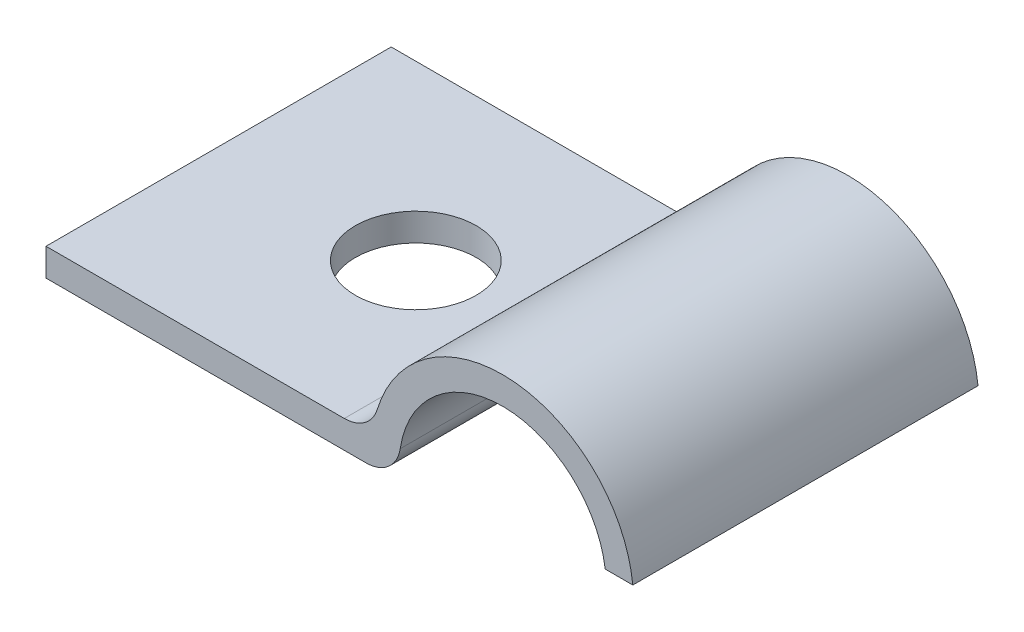
ISO-10303-21;
HEADER;
FILE_DESCRIPTION(('STEP AP214'),'2;1');
FILE_NAME('part.step','',(''),(''),'','','');
FILE_SCHEMA(('AUTOMOTIVE_DESIGN { 1 0 10303 214 1 1 1 1 }'));
ENDSEC;
DATA;
#1=APPLICATION_CONTEXT('core data for automotive mechanical design processes');
#2=APPLICATION_PROTOCOL_DEFINITION('international standard','automotive_design',2000,#1);
#3=PRODUCT_CONTEXT('',#1,'mechanical');
#4=PRODUCT('Part','Part','',(#3));
#5=PRODUCT_RELATED_PRODUCT_CATEGORY('part','',(#4));
#6=PRODUCT_DEFINITION_FORMATION('','',#4);
#7=PRODUCT_DEFINITION_CONTEXT('part definition',#1,'design');
#8=PRODUCT_DEFINITION('design','',#6,#7);
#9=PRODUCT_DEFINITION_SHAPE('','',#8);
#10=(LENGTH_UNIT() NAMED_UNIT(*) SI_UNIT(.MILLI.,.METRE.));
#11=(NAMED_UNIT(*) PLANE_ANGLE_UNIT() SI_UNIT($,.RADIAN.));
#12=(NAMED_UNIT(*) SI_UNIT($,.STERADIAN.) SOLID_ANGLE_UNIT());
#13=UNCERTAINTY_MEASURE_WITH_UNIT(LENGTH_MEASURE(1.E-05),#10,'distance_accuracy_value','');
#14=(GEOMETRIC_REPRESENTATION_CONTEXT(3) GLOBAL_UNCERTAINTY_ASSIGNED_CONTEXT((#13)) GLOBAL_UNIT_ASSIGNED_CONTEXT((#10,
#11,#12)) REPRESENTATION_CONTEXT('',''));
#15=CARTESIAN_POINT('',(0.,0.,0.));
#16=DIRECTION('',(0.,0.,1.));
#17=DIRECTION('',(1.,0.,0.));
#18=AXIS2_PLACEMENT_3D('',#15,#16,#17);
#19=CARTESIAN_POINT('',(0.,0.,10.));
#20=DIRECTION('',(1.,0.,0.));
#21=DIRECTION('',(0.,0.,-1.));
#22=AXIS2_PLACEMENT_3D('',#19,#20,#21);
#23=PLANE('',#22);
#24=DIRECTION('',(0.,-1.,0.));
#25=VECTOR('',#24,1.);
#26=CARTESIAN_POINT('',(0.,0.,0.));
#27=LINE('',#26,#25);
#28=CARTESIAN_POINT('',(0.,0.800000000000023,0.));
#29=VERTEX_POINT('',#28);
#30=CARTESIAN_POINT('',(0.,0.,0.));
#31=VERTEX_POINT('',#30);
#32=EDGE_CURVE('E115',#29,#31,#27,.T.);
#33=ORIENTED_EDGE('',*,*,#32,.T.);
#34=DIRECTION('',(0.,0.,-1.));
#35=VECTOR('',#34,1.);
#36=CARTESIAN_POINT('',(0.,0.,10.));
#37=LINE('',#36,#35);
#38=CARTESIAN_POINT('',(0.,0.,10.));
#39=VERTEX_POINT('',#38);
#40=EDGE_CURVE('E98',#39,#31,#37,.T.);
#41=ORIENTED_EDGE('',*,*,#40,.F.);
#42=DIRECTION('',(0.,-1.,0.));
#43=VECTOR('',#42,1.);
#44=CARTESIAN_POINT('',(0.,0.,10.));
#45=LINE('',#44,#43);
#46=CARTESIAN_POINT('',(0.,0.800000000000023,10.));
#47=VERTEX_POINT('',#46);
#48=EDGE_CURVE('E103',#47,#39,#45,.T.);
#49=ORIENTED_EDGE('',*,*,#48,.F.);
#50=DIRECTION('',(0.,0.,-1.));
#51=VECTOR('',#50,1.);
#52=CARTESIAN_POINT('',(0.,0.800000000000023,10.));
#53=LINE('',#52,#51);
#54=EDGE_CURVE('E156',#47,#29,#53,.T.);
#55=ORIENTED_EDGE('',*,*,#54,.T.);
#56=EDGE_LOOP('',(#33,#41,#49,#55));
#57=FACE_BOUND('',#56,.T.);
#58=ADVANCED_FACE('F32',(#57),#23,.F.);
#59=CARTESIAN_POINT('',(0.,0.,10.));
#60=DIRECTION('',(0.,1.,0.));
#61=DIRECTION('',(0.,0.,1.));
#62=AXIS2_PLACEMENT_3D('',#59,#60,#61);
#63=PLANE('',#62);
#64=CARTESIAN_POINT('',(5.71339312526814,0.,5.));
#65=DIRECTION('',(0.,1.,0.));
#66=DIRECTION('',(-1.,0.,0.));
#67=AXIS2_PLACEMENT_3D('',#64,#65,#66);
#68=CIRCLE('',#67,1.75);
#69=CARTESIAN_POINT('',(3.96339312526814,0.,5.));
#70=VERTEX_POINT('',#69);
#71=EDGE_CURVE('E165',#70,#70,#68,.T.);
#72=ORIENTED_EDGE('',*,*,#71,.T.);
#73=EDGE_LOOP('',(#72));
#74=FACE_BOUND('',#73,.T.);
#75=DIRECTION('',(1.,0.,0.));
#76=VECTOR('',#75,1.);
#77=CARTESIAN_POINT('',(0.,0.,0.));
#78=LINE('',#77,#76);
#79=CARTESIAN_POINT('',(9.27204226387923,0.,0.));
#80=VERTEX_POINT('',#79);
#81=EDGE_CURVE('E164',#31,#80,#78,.T.);
#82=ORIENTED_EDGE('',*,*,#81,.T.);
#83=DIRECTION('',(0.,0.,-1.));
#84=VECTOR('',#83,1.);
#85=CARTESIAN_POINT('',(9.27204226387929,0.,10.));
#86=LINE('',#85,#84);
#87=CARTESIAN_POINT('',(9.27204226387929,0.,10.));
#88=VERTEX_POINT('',#87);
#89=EDGE_CURVE('E47',#80,#88,#86,.F.);
#90=ORIENTED_EDGE('',*,*,#89,.T.);
#91=DIRECTION('',(1.,0.,0.));
#92=VECTOR('',#91,1.);
#93=CARTESIAN_POINT('',(0.,0.,10.));
#94=LINE('',#93,#92);
#95=EDGE_CURVE('E94',#39,#88,#94,.T.);
#96=ORIENTED_EDGE('',*,*,#95,.F.);
#97=ORIENTED_EDGE('',*,*,#40,.T.);
#98=EDGE_LOOP('',(#82,#90,#96,#97));
#99=FACE_BOUND('',#98,.T.);
#100=ADVANCED_FACE('F96',(#74,#99),#63,.F.);
#101=CARTESIAN_POINT('',(13.2267862505363,0.399999999999956,10.));
#102=DIRECTION('',(0.,0.,-1.));
#103=DIRECTION('',(-1.,0.,0.));
#104=AXIS2_PLACEMENT_3D('',#101,#102,#103);
#105=CYLINDRICAL_SURFACE('',#104,3.);
#106=CARTESIAN_POINT('',(13.2267862505363,0.399999999999956,10.));
#107=DIRECTION('',(0.,0.,-1.));
#108=DIRECTION('',(-1.,0.,0.));
#109=AXIS2_PLACEMENT_3D('',#106,#107,#108);
#110=CIRCLE('',#109,3.);
#111=CARTESIAN_POINT('',(10.2607282605435,0.850000000000017,10.));
#112=VERTEX_POINT('',#111);
#113=CARTESIAN_POINT('',(16.2,0.800000000000023,10.));
#114=VERTEX_POINT('',#113);
#115=EDGE_CURVE('E102',#112,#114,#110,.T.);
#116=ORIENTED_EDGE('',*,*,#115,.F.);
#117=DIRECTION('',(0.,0.,-1.));
#118=VECTOR('',#117,1.);
#119=CARTESIAN_POINT('',(10.2607282605435,0.850000000000017,10.));
#120=LINE('',#119,#118);
#121=CARTESIAN_POINT('',(10.2607282605435,0.850000000000017,0.));
#122=VERTEX_POINT('',#121);
#123=EDGE_CURVE('E128',#112,#122,#120,.T.);
#124=ORIENTED_EDGE('',*,*,#123,.T.);
#125=CARTESIAN_POINT('',(13.2267862505363,0.399999999999956,0.));
#126=DIRECTION('',(0.,0.,-1.));
#127=DIRECTION('',(-1.,0.,0.));
#128=AXIS2_PLACEMENT_3D('',#125,#126,#127);
#129=CIRCLE('',#128,3.);
#130=CARTESIAN_POINT('',(16.2,0.800000000000023,0.));
#131=VERTEX_POINT('',#130);
#132=EDGE_CURVE('E167',#122,#131,#129,.T.);
#133=ORIENTED_EDGE('',*,*,#132,.T.);
#134=DIRECTION('',(0.,0.,-1.));
#135=VECTOR('',#134,1.);
#136=CARTESIAN_POINT('',(16.2,0.800000000000023,10.));
#137=LINE('',#136,#135);
#138=EDGE_CURVE('E117',#114,#131,#137,.T.);
#139=ORIENTED_EDGE('',*,*,#138,.F.);
#140=EDGE_LOOP('',(#116,#124,#133,#139));
#141=FACE_BOUND('',#140,.T.);
#142=ADVANCED_FACE('F175',(#141),#105,.F.);
#143=CARTESIAN_POINT('',(16.2,0.800000000000023,10.));
#144=DIRECTION('',(0.,1.,0.));
#145=DIRECTION('',(0.,0.,1.));
#146=AXIS2_PLACEMENT_3D('',#143,#144,#145);
#147=PLANE('',#146);
#148=DIRECTION('',(1.,0.,0.));
#149=VECTOR('',#148,1.);
#150=CARTESIAN_POINT('',(16.2,0.800000000000023,0.));
#151=LINE('',#150,#149);
#152=CARTESIAN_POINT('',(17.,0.800000000000023,0.));
#153=VERTEX_POINT('',#152);
#154=EDGE_CURVE('E149',#131,#153,#151,.T.);
#155=ORIENTED_EDGE('',*,*,#154,.T.);
#156=DIRECTION('',(0.,0.,-1.));
#157=VECTOR('',#156,1.);
#158=CARTESIAN_POINT('',(17.,0.800000000000023,10.));
#159=LINE('',#158,#157);
#160=CARTESIAN_POINT('',(17.,0.800000000000023,10.));
#161=VERTEX_POINT('',#160);
#162=EDGE_CURVE('E123',#161,#153,#159,.T.);
#163=ORIENTED_EDGE('',*,*,#162,.F.);
#164=DIRECTION('',(1.,0.,0.));
#165=VECTOR('',#164,1.);
#166=CARTESIAN_POINT('',(16.2,0.800000000000023,10.));
#167=LINE('',#166,#165);
#168=EDGE_CURVE('E159',#114,#161,#167,.T.);
#169=ORIENTED_EDGE('',*,*,#168,.F.);
#170=ORIENTED_EDGE('',*,*,#138,.T.);
#171=EDGE_LOOP('',(#155,#163,#169,#170));
#172=FACE_BOUND('',#171,.T.);
#173=ADVANCED_FACE('F199',(#172),#147,.F.);
#174=CARTESIAN_POINT('',(13.2267862505363,0.399999999999956,10.));
#175=DIRECTION('',(0.,0.,-1.));
#176=DIRECTION('',(-1.,0.,0.));
#177=AXIS2_PLACEMENT_3D('',#174,#175,#176);
#178=CYLINDRICAL_SURFACE('',#177,3.79435659883753);
#179=CARTESIAN_POINT('',(13.2267862505363,0.399999999999956,0.));
#180=DIRECTION('',(0.,0.,1.));
#181=DIRECTION('',(-1.,0.,0.));
#182=AXIS2_PLACEMENT_3D('',#179,#180,#181);
#183=CIRCLE('',#182,3.79435659883753);
#184=CARTESIAN_POINT('',(9.59780565999985,1.50799001468949,0.));
#185=VERTEX_POINT('',#184);
#186=EDGE_CURVE('E139',#153,#185,#183,.T.);
#187=ORIENTED_EDGE('',*,*,#186,.T.);
#188=DIRECTION('',(0.,0.,-1.));
#189=VECTOR('',#188,1.);
#190=CARTESIAN_POINT('',(9.59780565999985,1.50799001468949,10.));
#191=LINE('',#190,#189);
#192=CARTESIAN_POINT('',(9.59780565999985,1.50799001468949,10.));
#193=VERTEX_POINT('',#192);
#194=EDGE_CURVE('E120',#185,#193,#191,.F.);
#195=ORIENTED_EDGE('',*,*,#194,.T.);
#196=CARTESIAN_POINT('',(13.2267862505363,0.399999999999956,10.));
#197=DIRECTION('',(0.,0.,1.));
#198=DIRECTION('',(-1.,0.,0.));
#199=AXIS2_PLACEMENT_3D('',#196,#197,#198);
#200=CIRCLE('',#199,3.79435659883753);
#201=EDGE_CURVE('E153',#161,#193,#200,.T.);
#202=ORIENTED_EDGE('',*,*,#201,.F.);
#203=ORIENTED_EDGE('',*,*,#162,.T.);
#204=EDGE_LOOP('',(#187,#195,#202,#203));
#205=FACE_BOUND('',#204,.T.);
#206=ADVANCED_FACE('F145',(#205),#178,.T.);
#207=CARTESIAN_POINT('',(0.,0.800000000000023,10.));
#208=DIRECTION('',(0.,-1.,0.));
#209=DIRECTION('',(1.,0.,0.));
#210=AXIS2_PLACEMENT_3D('',#207,#208,#209);
#211=PLANE('',#210);
#212=CARTESIAN_POINT('',(5.71339312526814,0.800000000000023,5.));
#213=DIRECTION('',(0.,1.,0.));
#214=DIRECTION('',(-1.,0.,0.));
#215=AXIS2_PLACEMENT_3D('',#212,#213,#214);
#216=CIRCLE('',#215,1.75);
#217=CARTESIAN_POINT('',(3.96339312526814,0.800000000000023,5.));
#218=VERTEX_POINT('',#217);
#219=EDGE_CURVE('E179',#218,#218,#216,.T.);
#220=ORIENTED_EDGE('',*,*,#219,.F.);
#221=EDGE_LOOP('',(#220));
#222=FACE_BOUND('',#221,.T.);
#223=DIRECTION('',(-1.,0.,0.));
#224=VECTOR('',#223,1.);
#225=CARTESIAN_POINT('',(0.,0.800000000000023,10.));
#226=LINE('',#225,#224);
#227=CARTESIAN_POINT('',(8.64139039010975,0.800000000000023,10.));
#228=VERTEX_POINT('',#227);
#229=EDGE_CURVE('E108',#228,#47,#226,.T.);
#230=ORIENTED_EDGE('',*,*,#229,.F.);
#231=DIRECTION('',(0.,0.,1.));
#232=VECTOR('',#231,1.);
#233=CARTESIAN_POINT('',(8.64139039010975,0.800000000000023,0.));
#234=LINE('',#233,#232);
#235=CARTESIAN_POINT('',(8.64139039010975,0.800000000000023,0.));
#236=VERTEX_POINT('',#235);
#237=EDGE_CURVE('E116',#228,#236,#234,.F.);
#238=ORIENTED_EDGE('',*,*,#237,.T.);
#239=DIRECTION('',(-1.,0.,0.));
#240=VECTOR('',#239,1.);
#241=CARTESIAN_POINT('',(0.,0.800000000000023,0.));
#242=LINE('',#241,#240);
#243=EDGE_CURVE('E112',#236,#29,#242,.T.);
#244=ORIENTED_EDGE('',*,*,#243,.T.);
#245=ORIENTED_EDGE('',*,*,#54,.F.);
#246=EDGE_LOOP('',(#230,#238,#244,#245));
#247=FACE_BOUND('',#246,.T.);
#248=ADVANCED_FACE('F155',(#222,#247),#211,.F.);
#249=CARTESIAN_POINT('',(13.2267862505363,0.399999999999956,10.));
#250=DIRECTION('',(0.,0.,-1.));
#251=DIRECTION('',(-1.,0.,0.));
#252=AXIS2_PLACEMENT_3D('',#249,#250,#251);
#253=PLANE('',#252);
#254=ORIENTED_EDGE('',*,*,#95,.T.);
#255=CARTESIAN_POINT('',(9.27204226387929,1.,10.));
#256=DIRECTION('',(0.,0.,-1.));
#257=DIRECTION('',(-1.,0.,0.));
#258=AXIS2_PLACEMENT_3D('',#255,#256,#257);
#259=CIRCLE('',#258,1.);
#260=EDGE_CURVE('E133',#88,#112,#259,.F.);
#261=ORIENTED_EDGE('',*,*,#260,.T.);
#262=ORIENTED_EDGE('',*,*,#115,.T.);
#263=ORIENTED_EDGE('',*,*,#168,.T.);
#264=ORIENTED_EDGE('',*,*,#201,.T.);
#265=CARTESIAN_POINT('',(8.64139039010975,1.80000000000002,10.));
#266=DIRECTION('',(0.,0.,-1.));
#267=DIRECTION('',(-1.,0.,0.));
#268=AXIS2_PLACEMENT_3D('',#265,#266,#267);
#269=CIRCLE('',#268,1.);
#270=EDGE_CURVE('E11',#193,#228,#269,.T.);
#271=ORIENTED_EDGE('',*,*,#270,.T.);
#272=ORIENTED_EDGE('',*,*,#229,.T.);
#273=ORIENTED_EDGE('',*,*,#48,.T.);
#274=EDGE_LOOP('',(#254,#261,#262,#263,#264,#271,#272,#273));
#275=FACE_BOUND('',#274,.T.);
#276=ADVANCED_FACE('F106',(#275),#253,.F.);
#277=CARTESIAN_POINT('',(13.2267862505363,0.399999999999956,0.));
#278=DIRECTION('',(0.,0.,-1.));
#279=DIRECTION('',(-1.,0.,0.));
#280=AXIS2_PLACEMENT_3D('',#277,#278,#279);
#281=PLANE('',#280);
#282=ORIENTED_EDGE('',*,*,#132,.F.);
#283=CARTESIAN_POINT('',(9.27204226387923,1.,0.));
#284=DIRECTION('',(0.,0.,-1.));
#285=DIRECTION('',(-1.,0.,0.));
#286=AXIS2_PLACEMENT_3D('',#283,#284,#285);
#287=CIRCLE('',#286,1.);
#288=EDGE_CURVE('E55',#122,#80,#287,.T.);
#289=ORIENTED_EDGE('',*,*,#288,.T.);
#290=ORIENTED_EDGE('',*,*,#81,.F.);
#291=ORIENTED_EDGE('',*,*,#32,.F.);
#292=ORIENTED_EDGE('',*,*,#243,.F.);
#293=CARTESIAN_POINT('',(8.64139039010975,1.80000000000002,0.));
#294=DIRECTION('',(0.,0.,-1.));
#295=DIRECTION('',(-1.,0.,0.));
#296=AXIS2_PLACEMENT_3D('',#293,#294,#295);
#297=CIRCLE('',#296,1.);
#298=EDGE_CURVE('E40',#236,#185,#297,.F.);
#299=ORIENTED_EDGE('',*,*,#298,.T.);
#300=ORIENTED_EDGE('',*,*,#186,.F.);
#301=ORIENTED_EDGE('',*,*,#154,.F.);
#302=EDGE_LOOP('',(#282,#289,#290,#291,#292,#299,#300,#301));
#303=FACE_BOUND('',#302,.T.);
#304=ADVANCED_FACE('F137',(#303),#281,.T.);
#305=CARTESIAN_POINT('',(8.64139039010975,1.80000000000002,10.));
#306=DIRECTION('',(0.,0.,-1.));
#307=DIRECTION('',(-1.,0.,0.));
#308=AXIS2_PLACEMENT_3D('',#305,#306,#307);
#309=CYLINDRICAL_SURFACE('',#308,1.);
#310=ORIENTED_EDGE('',*,*,#270,.F.);
#311=ORIENTED_EDGE('',*,*,#194,.F.);
#312=ORIENTED_EDGE('',*,*,#298,.F.);
#313=ORIENTED_EDGE('',*,*,#237,.F.);
#314=EDGE_LOOP('',(#310,#311,#312,#313));
#315=FACE_BOUND('',#314,.T.);
#316=ADVANCED_FACE('F152',(#315),#309,.F.);
#317=CARTESIAN_POINT('',(9.27204226387929,1.,10.));
#318=DIRECTION('',(0.,0.,-1.));
#319=DIRECTION('',(-1.,0.,0.));
#320=AXIS2_PLACEMENT_3D('',#317,#318,#319);
#321=CYLINDRICAL_SURFACE('',#320,1.);
#322=ORIENTED_EDGE('',*,*,#260,.F.);
#323=ORIENTED_EDGE('',*,*,#89,.F.);
#324=ORIENTED_EDGE('',*,*,#288,.F.);
#325=ORIENTED_EDGE('',*,*,#123,.F.);
#326=EDGE_LOOP('',(#322,#323,#324,#325));
#327=FACE_BOUND('',#326,.T.);
#328=ADVANCED_FACE('F34',(#327),#321,.T.);
#329=CARTESIAN_POINT('',(5.71339312526814,0.,5.));
#330=DIRECTION('',(0.,1.,0.));
#331=DIRECTION('',(-1.,0.,0.));
#332=AXIS2_PLACEMENT_3D('',#329,#330,#331);
#333=CYLINDRICAL_SURFACE('',#332,1.75);
#334=ORIENTED_EDGE('',*,*,#71,.F.);
#335=EDGE_LOOP('',(#334));
#336=FACE_BOUND('',#335,.T.);
#337=ORIENTED_EDGE('',*,*,#219,.T.);
#338=EDGE_LOOP('',(#337));
#339=FACE_BOUND('',#338,.T.);
#340=ADVANCED_FACE('F186',(#336,#339),#333,.F.);
#341=CLOSED_SHELL('',(#58,#100,#142,#173,#206,#248,#276,#304,#316,#328,#340));
#342=MANIFOLD_SOLID_BREP('B2',#341);
#343=ADVANCED_BREP_SHAPE_REPRESENTATION('',(#18,#342),#14);
#344=SHAPE_DEFINITION_REPRESENTATION(#9,#343);
ENDSEC;
END-ISO-10303-21;
